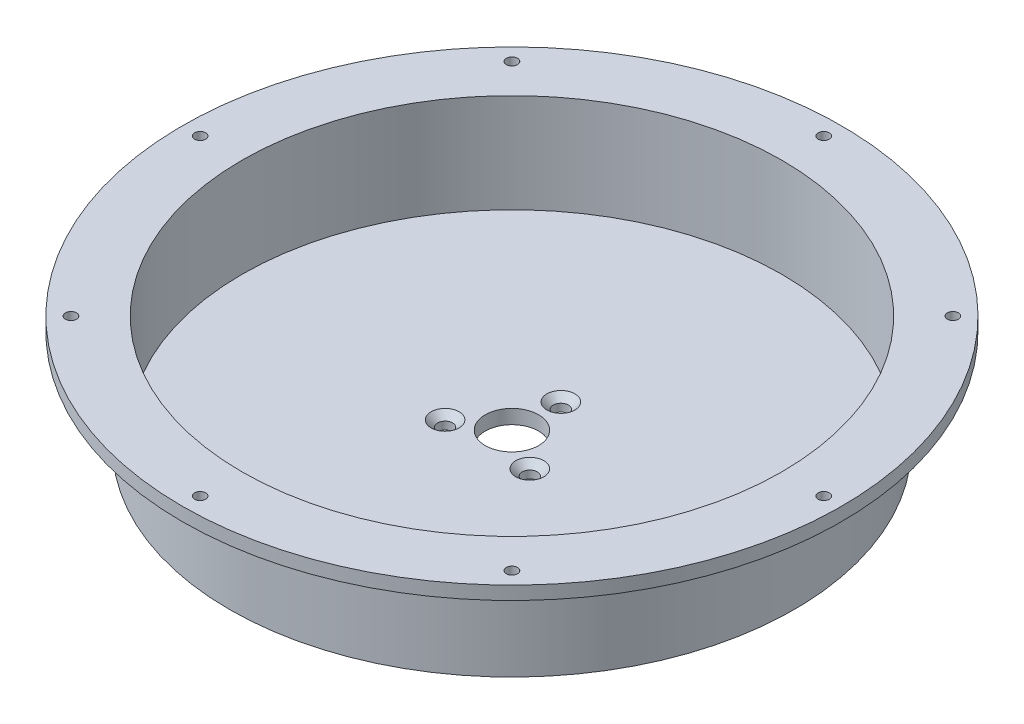
ISO-10303-21;
HEADER;
FILE_DESCRIPTION(('STEP AP214'),'2;1');
FILE_NAME('part.step','',(''),(''),'','','');
FILE_SCHEMA(('AUTOMOTIVE_DESIGN { 1 0 10303 214 1 1 1 1 }'));
ENDSEC;
DATA;
#1=APPLICATION_CONTEXT('core data for automotive mechanical design processes');
#2=APPLICATION_PROTOCOL_DEFINITION('international standard','automotive_design',2000,#1);
#3=PRODUCT_CONTEXT('',#1,'mechanical');
#4=PRODUCT('Part','Part','',(#3));
#5=PRODUCT_RELATED_PRODUCT_CATEGORY('part','',(#4));
#6=PRODUCT_DEFINITION_FORMATION('','',#4);
#7=PRODUCT_DEFINITION_CONTEXT('part definition',#1,'design');
#8=PRODUCT_DEFINITION('design','',#6,#7);
#9=PRODUCT_DEFINITION_SHAPE('','',#8);
#10=(LENGTH_UNIT() NAMED_UNIT(*) SI_UNIT(.MILLI.,.METRE.));
#11=(NAMED_UNIT(*) PLANE_ANGLE_UNIT() SI_UNIT($,.RADIAN.));
#12=(NAMED_UNIT(*) SI_UNIT($,.STERADIAN.) SOLID_ANGLE_UNIT());
#13=UNCERTAINTY_MEASURE_WITH_UNIT(LENGTH_MEASURE(1.E-05),#10,'distance_accuracy_value','');
#14=(GEOMETRIC_REPRESENTATION_CONTEXT(3) GLOBAL_UNCERTAINTY_ASSIGNED_CONTEXT((#13)) GLOBAL_UNIT_ASSIGNED_CONTEXT((#10,
#11,#12)) REPRESENTATION_CONTEXT('',''));
#15=CARTESIAN_POINT('',(0.,0.,0.));
#16=DIRECTION('',(0.,0.,1.));
#17=DIRECTION('',(1.,0.,0.));
#18=AXIS2_PLACEMENT_3D('',#15,#16,#17);
#19=CARTESIAN_POINT('',(0.,25.4,0.));
#20=DIRECTION('',(0.,-1.,0.));
#21=DIRECTION('',(0.,0.,-1.));
#22=AXIS2_PLACEMENT_3D('',#19,#20,#21);
#23=CYLINDRICAL_SURFACE('',#22,63.5);
#24=CARTESIAN_POINT('',(0.,19.4,0.));
#25=DIRECTION('',(0.,1.,0.));
#26=DIRECTION('',(0.,0.,1.));
#27=AXIS2_PLACEMENT_3D('',#24,#25,#26);
#28=CIRCLE('',#27,63.5);
#29=CARTESIAN_POINT('',(0.,19.4,63.5));
#30=VERTEX_POINT('',#29);
#31=EDGE_CURVE('E11',#30,#30,#28,.F.);
#32=ORIENTED_EDGE('',*,*,#31,.T.);
#33=EDGE_LOOP('',(#32));
#34=FACE_BOUND('',#33,.T.);
#35=CARTESIAN_POINT('',(0.,0.,0.));
#36=DIRECTION('',(0.,1.,0.));
#37=DIRECTION('',(0.,0.,1.));
#38=AXIS2_PLACEMENT_3D('',#35,#36,#37);
#39=CIRCLE('',#38,63.5);
#40=CARTESIAN_POINT('',(0.,0.,63.5));
#41=VERTEX_POINT('',#40);
#42=EDGE_CURVE('E74',#41,#41,#39,.T.);
#43=ORIENTED_EDGE('',*,*,#42,.T.);
#44=EDGE_LOOP('',(#43));
#45=FACE_BOUND('',#44,.T.);
#46=ADVANCED_FACE('F56',(#34,#45),#23,.T.);
#47=CARTESIAN_POINT('',(0.,25.4,0.));
#48=DIRECTION('',(0.,1.,0.));
#49=DIRECTION('',(0.,0.,1.));
#50=AXIS2_PLACEMENT_3D('',#47,#48,#49);
#51=PLANE('',#50);
#52=CARTESIAN_POINT('',(49.5681853611764,25.4,-49.5681853611776));
#53=DIRECTION('',(0.,1.,0.));
#54=DIRECTION('',(0.,0.,1.));
#55=AXIS2_PLACEMENT_3D('',#52,#53,#54);
#56=CIRCLE('',#55,1.24999999999999);
#57=CARTESIAN_POINT('',(49.5681853611764,25.4,-48.3181853611776));
#58=VERTEX_POINT('',#57);
#59=EDGE_CURVE('E82',#58,#58,#56,.T.);
#60=ORIENTED_EDGE('',*,*,#59,.F.);
#61=EDGE_LOOP('',(#60));
#62=FACE_BOUND('',#61,.T.);
#63=CARTESIAN_POINT('',(70.1,25.4,-7.34258525558711E-13));
#64=DIRECTION('',(0.,1.,0.));
#65=DIRECTION('',(0.,0.,1.));
#66=AXIS2_PLACEMENT_3D('',#63,#64,#65);
#67=CIRCLE('',#66,1.24999999999999);
#68=CARTESIAN_POINT('',(70.1,25.4,1.24999999999925));
#69=VERTEX_POINT('',#68);
#70=EDGE_CURVE('E81',#69,#69,#67,.T.);
#71=ORIENTED_EDGE('',*,*,#70,.F.);
#72=EDGE_LOOP('',(#71));
#73=FACE_BOUND('',#72,.T.);
#74=CARTESIAN_POINT('',(49.5681853611774,25.4,49.5681853611765));
#75=DIRECTION('',(0.,1.,0.));
#76=DIRECTION('',(0.,0.,1.));
#77=AXIS2_PLACEMENT_3D('',#74,#75,#76);
#78=CIRCLE('',#77,1.24999999999999);
#79=CARTESIAN_POINT('',(49.5681853611774,25.4,50.8181853611765));
#80=VERTEX_POINT('',#79);
#81=EDGE_CURVE('E88',#80,#80,#78,.T.);
#82=ORIENTED_EDGE('',*,*,#81,.F.);
#83=EDGE_LOOP('',(#82));
#84=FACE_BOUND('',#83,.T.);
#85=CARTESIAN_POINT('',(0.,25.4,70.1));
#86=DIRECTION('',(0.,1.,0.));
#87=DIRECTION('',(0.,0.,1.));
#88=AXIS2_PLACEMENT_3D('',#85,#86,#87);
#89=CIRCLE('',#88,1.24999999999999);
#90=CARTESIAN_POINT('',(0.,25.4,71.35));
#91=VERTEX_POINT('',#90);
#92=EDGE_CURVE('E87',#91,#91,#89,.T.);
#93=ORIENTED_EDGE('',*,*,#92,.F.);
#94=EDGE_LOOP('',(#93));
#95=FACE_BOUND('',#94,.T.);
#96=CARTESIAN_POINT('',(-49.5681853611767,25.4,49.5681853611772));
#97=DIRECTION('',(0.,1.,0.));
#98=DIRECTION('',(0.,0.,1.));
#99=AXIS2_PLACEMENT_3D('',#96,#97,#98);
#100=CIRCLE('',#99,1.24999999999999);
#101=CARTESIAN_POINT('',(-49.5681853611767,25.4,50.8181853611772));
#102=VERTEX_POINT('',#101);
#103=EDGE_CURVE('E94',#102,#102,#100,.T.);
#104=ORIENTED_EDGE('',*,*,#103,.F.);
#105=EDGE_LOOP('',(#104));
#106=FACE_BOUND('',#105,.T.);
#107=CARTESIAN_POINT('',(-70.1,25.4,2.44752841852904E-13));
#108=DIRECTION('',(0.,1.,0.));
#109=DIRECTION('',(0.,0.,1.));
#110=AXIS2_PLACEMENT_3D('',#107,#108,#109);
#111=CIRCLE('',#110,1.24999999999999);
#112=CARTESIAN_POINT('',(-70.1,25.4,1.25000000000023));
#113=VERTEX_POINT('',#112);
#114=EDGE_CURVE('E93',#113,#113,#111,.T.);
#115=ORIENTED_EDGE('',*,*,#114,.F.);
#116=EDGE_LOOP('',(#115));
#117=FACE_BOUND('',#116,.T.);
#118=CARTESIAN_POINT('',(-49.5681853611771,25.4,-49.5681853611769));
#119=DIRECTION('',(0.,1.,0.));
#120=DIRECTION('',(0.,0.,1.));
#121=AXIS2_PLACEMENT_3D('',#118,#119,#120);
#122=CIRCLE('',#121,1.24999999999999);
#123=CARTESIAN_POINT('',(-49.5681853611771,25.4,-48.3181853611769));
#124=VERTEX_POINT('',#123);
#125=EDGE_CURVE('E99',#124,#124,#122,.T.);
#126=ORIENTED_EDGE('',*,*,#125,.F.);
#127=EDGE_LOOP('',(#126));
#128=FACE_BOUND('',#127,.T.);
#129=CARTESIAN_POINT('',(0.,25.4,-70.1));
#130=DIRECTION('',(0.,1.,0.));
#131=DIRECTION('',(0.,0.,1.));
#132=AXIS2_PLACEMENT_3D('',#129,#130,#131);
#133=CIRCLE('',#132,1.24999999999999);
#134=CARTESIAN_POINT('',(0.,25.4,-68.85));
#135=VERTEX_POINT('',#134);
#136=EDGE_CURVE('E98',#135,#135,#133,.T.);
#137=ORIENTED_EDGE('',*,*,#136,.F.);
#138=EDGE_LOOP('',(#137));
#139=FACE_BOUND('',#138,.T.);
#140=CARTESIAN_POINT('',(0.,25.4,0.));
#141=DIRECTION('',(0.,1.,0.));
#142=DIRECTION('',(0.,0.,1.));
#143=AXIS2_PLACEMENT_3D('',#140,#141,#142);
#144=CIRCLE('',#143,60.690000065);
#145=CARTESIAN_POINT('',(0.,25.4,60.690000065));
#146=VERTEX_POINT('',#145);
#147=EDGE_CURVE('E104',#146,#146,#144,.T.);
#148=ORIENTED_EDGE('',*,*,#147,.F.);
#149=EDGE_LOOP('',(#148));
#150=FACE_BOUND('',#149,.T.);
#151=CARTESIAN_POINT('',(0.,25.4,0.));
#152=DIRECTION('',(0.,1.,0.));
#153=DIRECTION('',(0.,0.,1.));
#154=AXIS2_PLACEMENT_3D('',#151,#152,#153);
#155=CIRCLE('',#154,74.0950000325);
#156=CARTESIAN_POINT('',(0.,25.4,74.0950000325));
#157=VERTEX_POINT('',#156);
#158=EDGE_CURVE('E117',#157,#157,#155,.T.);
#159=ORIENTED_EDGE('',*,*,#158,.T.);
#160=EDGE_LOOP('',(#159));
#161=FACE_BOUND('',#160,.T.);
#162=ADVANCED_FACE('F223',(#62,#73,#84,#95,#106,#117,#128,#139,#150,#161),#51,.T.);
#163=CARTESIAN_POINT('',(0.,0.,0.));
#164=DIRECTION('',(0.,1.,0.));
#165=DIRECTION('',(0.,0.,1.));
#166=AXIS2_PLACEMENT_3D('',#163,#164,#165);
#167=PLANE('',#166);
#168=CARTESIAN_POINT('',(-9.52627944162887,0.,5.49999999999991));
#169=DIRECTION('',(0.,1.,0.));
#170=DIRECTION('',(0.,0.,1.));
#171=AXIS2_PLACEMENT_3D('',#168,#169,#170);
#172=CIRCLE('',#171,1.7);
#173=CARTESIAN_POINT('',(-9.52627944162887,0.,7.19999999999991));
#174=VERTEX_POINT('',#173);
#175=EDGE_CURVE('E188',#174,#174,#172,.T.);
#176=ORIENTED_EDGE('',*,*,#175,.T.);
#177=EDGE_LOOP('',(#176));
#178=FACE_BOUND('',#177,.T.);
#179=CARTESIAN_POINT('',(9.5262794416288,0.,5.50000000000004));
#180=DIRECTION('',(0.,1.,0.));
#181=DIRECTION('',(0.,0.,1.));
#182=AXIS2_PLACEMENT_3D('',#179,#180,#181);
#183=CIRCLE('',#182,1.7);
#184=CARTESIAN_POINT('',(9.5262794416288,0.,7.20000000000004));
#185=VERTEX_POINT('',#184);
#186=EDGE_CURVE('E176',#185,#185,#183,.T.);
#187=ORIENTED_EDGE('',*,*,#186,.T.);
#188=EDGE_LOOP('',(#187));
#189=FACE_BOUND('',#188,.T.);
#190=CARTESIAN_POINT('',(0.,0.,-11.));
#191=DIRECTION('',(0.,1.,0.));
#192=DIRECTION('',(0.,0.,1.));
#193=AXIS2_PLACEMENT_3D('',#190,#191,#192);
#194=CIRCLE('',#193,1.7);
#195=CARTESIAN_POINT('',(0.,0.,-9.3));
#196=VERTEX_POINT('',#195);
#197=EDGE_CURVE('E164',#196,#196,#194,.T.);
#198=ORIENTED_EDGE('',*,*,#197,.T.);
#199=EDGE_LOOP('',(#198));
#200=FACE_BOUND('',#199,.T.);
#201=CARTESIAN_POINT('',(0.,0.,0.));
#202=DIRECTION('',(0.,-1.,0.));
#203=DIRECTION('',(0.,0.,-1.));
#204=AXIS2_PLACEMENT_3D('',#201,#202,#203);
#205=CIRCLE('',#204,6.);
#206=CARTESIAN_POINT('',(0.,0.,-6.));
#207=VERTEX_POINT('',#206);
#208=EDGE_CURVE('E108',#207,#207,#205,.T.);
#209=ORIENTED_EDGE('',*,*,#208,.F.);
#210=EDGE_LOOP('',(#209));
#211=FACE_BOUND('',#210,.T.);
#212=ORIENTED_EDGE('',*,*,#42,.F.);
#213=EDGE_LOOP('',(#212));
#214=FACE_BOUND('',#213,.T.);
#215=ADVANCED_FACE('F219',(#178,#189,#200,#211,#214),#167,.F.);
#216=CARTESIAN_POINT('',(0.,25.4,0.));
#217=DIRECTION('',(0.,-1.,0.));
#218=DIRECTION('',(0.,0.,-1.));
#219=AXIS2_PLACEMENT_3D('',#216,#217,#218);
#220=CYLINDRICAL_SURFACE('',#219,60.690000065);
#221=CARTESIAN_POINT('',(0.,3.175,0.));
#222=DIRECTION('',(0.,1.,0.));
#223=DIRECTION('',(0.,0.,1.));
#224=AXIS2_PLACEMENT_3D('',#221,#222,#223);
#225=CIRCLE('',#224,60.690000065);
#226=CARTESIAN_POINT('',(0.,3.175,60.690000065));
#227=VERTEX_POINT('',#226);
#228=EDGE_CURVE('E69',#227,#227,#225,.T.);
#229=ORIENTED_EDGE('',*,*,#228,.F.);
#230=EDGE_LOOP('',(#229));
#231=FACE_BOUND('',#230,.T.);
#232=ORIENTED_EDGE('',*,*,#147,.T.);
#233=EDGE_LOOP('',(#232));
#234=FACE_BOUND('',#233,.T.);
#235=ADVANCED_FACE('F207',(#231,#234),#220,.F.);
#236=CARTESIAN_POINT('',(0.,3.175,0.));
#237=DIRECTION('',(0.,1.,0.));
#238=DIRECTION('',(0.,0.,1.));
#239=AXIS2_PLACEMENT_3D('',#236,#237,#238);
#240=PLANE('',#239);
#241=CARTESIAN_POINT('',(-9.52627944162887,3.175,5.49999999999991));
#242=DIRECTION('',(0.,1.,0.));
#243=DIRECTION('',(0.,0.,1.));
#244=AXIS2_PLACEMENT_3D('',#241,#242,#243);
#245=CIRCLE('',#244,3.15);
#246=CARTESIAN_POINT('',(-9.52627944162887,3.175,8.64999999999991));
#247=VERTEX_POINT('',#246);
#248=EDGE_CURVE('E196',#247,#247,#245,.T.);
#249=ORIENTED_EDGE('',*,*,#248,.F.);
#250=EDGE_LOOP('',(#249));
#251=FACE_BOUND('',#250,.T.);
#252=CARTESIAN_POINT('',(9.5262794416288,3.175,5.50000000000004));
#253=DIRECTION('',(0.,1.,0.));
#254=DIRECTION('',(0.,0.,1.));
#255=AXIS2_PLACEMENT_3D('',#252,#253,#254);
#256=CIRCLE('',#255,3.15);
#257=CARTESIAN_POINT('',(9.5262794416288,3.175,8.65000000000004));
#258=VERTEX_POINT('',#257);
#259=EDGE_CURVE('E184',#258,#258,#256,.T.);
#260=ORIENTED_EDGE('',*,*,#259,.F.);
#261=EDGE_LOOP('',(#260));
#262=FACE_BOUND('',#261,.T.);
#263=CARTESIAN_POINT('',(0.,3.175,-11.));
#264=DIRECTION('',(0.,1.,0.));
#265=DIRECTION('',(0.,0.,1.));
#266=AXIS2_PLACEMENT_3D('',#263,#264,#265);
#267=CIRCLE('',#266,3.15);
#268=CARTESIAN_POINT('',(0.,3.175,-7.85));
#269=VERTEX_POINT('',#268);
#270=EDGE_CURVE('E172',#269,#269,#267,.T.);
#271=ORIENTED_EDGE('',*,*,#270,.F.);
#272=EDGE_LOOP('',(#271));
#273=FACE_BOUND('',#272,.T.);
#274=CARTESIAN_POINT('',(0.,3.175,0.));
#275=DIRECTION('',(0.,1.,0.));
#276=DIRECTION('',(0.,0.,1.));
#277=AXIS2_PLACEMENT_3D('',#274,#275,#276);
#278=CIRCLE('',#277,6.);
#279=CARTESIAN_POINT('',(0.,3.175,6.));
#280=VERTEX_POINT('',#279);
#281=EDGE_CURVE('E109',#280,#280,#278,.F.);
#282=ORIENTED_EDGE('',*,*,#281,.T.);
#283=EDGE_LOOP('',(#282));
#284=FACE_BOUND('',#283,.T.);
#285=ORIENTED_EDGE('',*,*,#228,.T.);
#286=EDGE_LOOP('',(#285));
#287=FACE_BOUND('',#286,.T.);
#288=ADVANCED_FACE('F203',(#251,#262,#273,#284,#287),#240,.T.);
#289=CARTESIAN_POINT('',(0.,25.401,0.));
#290=DIRECTION('',(0.,-1.,0.));
#291=DIRECTION('',(0.,0.,-1.));
#292=AXIS2_PLACEMENT_3D('',#289,#290,#291);
#293=CYLINDRICAL_SURFACE('',#292,6.);
#294=ORIENTED_EDGE('',*,*,#281,.F.);
#295=EDGE_LOOP('',(#294));
#296=FACE_BOUND('',#295,.T.);
#297=ORIENTED_EDGE('',*,*,#208,.T.);
#298=EDGE_LOOP('',(#297));
#299=FACE_BOUND('',#298,.T.);
#300=ADVANCED_FACE('F206',(#296,#299),#293,.F.);
#301=CARTESIAN_POINT('',(0.,22.4,0.));
#302=DIRECTION('',(0.,1.,0.));
#303=DIRECTION('',(0.,0.,1.));
#304=AXIS2_PLACEMENT_3D('',#301,#302,#303);
#305=CYLINDRICAL_SURFACE('',#304,74.0950000325);
#306=CARTESIAN_POINT('',(0.,22.4,0.));
#307=DIRECTION('',(0.,1.,0.));
#308=DIRECTION('',(0.,0.,1.));
#309=AXIS2_PLACEMENT_3D('',#306,#307,#308);
#310=CIRCLE('',#309,74.0950000325);
#311=CARTESIAN_POINT('',(0.,22.4,74.0950000325));
#312=VERTEX_POINT('',#311);
#313=EDGE_CURVE('E113',#312,#312,#310,.T.);
#314=ORIENTED_EDGE('',*,*,#313,.T.);
#315=EDGE_LOOP('',(#314));
#316=FACE_BOUND('',#315,.T.);
#317=ORIENTED_EDGE('',*,*,#158,.F.);
#318=EDGE_LOOP('',(#317));
#319=FACE_BOUND('',#318,.T.);
#320=ADVANCED_FACE('F230',(#316,#319),#305,.T.);
#321=CARTESIAN_POINT('',(0.,22.4,0.));
#322=DIRECTION('',(0.,1.,0.));
#323=DIRECTION('',(0.,0.,1.));
#324=AXIS2_PLACEMENT_3D('',#321,#322,#323);
#325=PLANE('',#324);
#326=CARTESIAN_POINT('',(0.,22.4,0.));
#327=DIRECTION('',(0.,1.,0.));
#328=DIRECTION('',(0.,0.,1.));
#329=AXIS2_PLACEMENT_3D('',#326,#327,#328);
#330=CIRCLE('',#329,66.5);
#331=CARTESIAN_POINT('',(0.,22.4,66.5));
#332=VERTEX_POINT('',#331);
#333=EDGE_CURVE('E64',#332,#332,#330,.T.);
#334=ORIENTED_EDGE('',*,*,#333,.T.);
#335=EDGE_LOOP('',(#334));
#336=FACE_BOUND('',#335,.T.);
#337=CARTESIAN_POINT('',(49.5681853611764,22.4,-49.5681853611776));
#338=DIRECTION('',(0.,1.,0.));
#339=DIRECTION('',(0.,0.,1.));
#340=AXIS2_PLACEMENT_3D('',#337,#338,#339);
#341=CIRCLE('',#340,1.24999999999999);
#342=CARTESIAN_POINT('',(49.5681853611764,22.4,-48.3181853611776));
#343=VERTEX_POINT('',#342);
#344=EDGE_CURVE('E77',#343,#343,#341,.T.);
#345=ORIENTED_EDGE('',*,*,#344,.T.);
#346=EDGE_LOOP('',(#345));
#347=FACE_BOUND('',#346,.T.);
#348=CARTESIAN_POINT('',(70.1,22.4,-7.34258525558711E-13));
#349=DIRECTION('',(0.,1.,0.));
#350=DIRECTION('',(0.,0.,1.));
#351=AXIS2_PLACEMENT_3D('',#348,#349,#350);
#352=CIRCLE('',#351,1.24999999999999);
#353=CARTESIAN_POINT('',(70.1,22.4,1.24999999999925));
#354=VERTEX_POINT('',#353);
#355=EDGE_CURVE('E154',#354,#354,#352,.T.);
#356=ORIENTED_EDGE('',*,*,#355,.T.);
#357=EDGE_LOOP('',(#356));
#358=FACE_BOUND('',#357,.T.);
#359=CARTESIAN_POINT('',(49.5681853611774,22.4,49.5681853611765));
#360=DIRECTION('',(0.,1.,0.));
#361=DIRECTION('',(0.,0.,1.));
#362=AXIS2_PLACEMENT_3D('',#359,#360,#361);
#363=CIRCLE('',#362,1.24999999999999);
#364=CARTESIAN_POINT('',(49.5681853611774,22.4,50.8181853611765));
#365=VERTEX_POINT('',#364);
#366=EDGE_CURVE('E83',#365,#365,#363,.T.);
#367=ORIENTED_EDGE('',*,*,#366,.T.);
#368=EDGE_LOOP('',(#367));
#369=FACE_BOUND('',#368,.T.);
#370=CARTESIAN_POINT('',(0.,22.4,70.1));
#371=DIRECTION('',(0.,1.,0.));
#372=DIRECTION('',(0.,0.,1.));
#373=AXIS2_PLACEMENT_3D('',#370,#371,#372);
#374=CIRCLE('',#373,1.24999999999999);
#375=CARTESIAN_POINT('',(0.,22.4,71.35));
#376=VERTEX_POINT('',#375);
#377=EDGE_CURVE('E144',#376,#376,#374,.T.);
#378=ORIENTED_EDGE('',*,*,#377,.T.);
#379=EDGE_LOOP('',(#378));
#380=FACE_BOUND('',#379,.T.);
#381=CARTESIAN_POINT('',(-49.5681853611767,22.4,49.5681853611772));
#382=DIRECTION('',(0.,1.,0.));
#383=DIRECTION('',(0.,0.,1.));
#384=AXIS2_PLACEMENT_3D('',#381,#382,#383);
#385=CIRCLE('',#384,1.24999999999999);
#386=CARTESIAN_POINT('',(-49.5681853611767,22.4,50.8181853611772));
#387=VERTEX_POINT('',#386);
#388=EDGE_CURVE('E89',#387,#387,#385,.T.);
#389=ORIENTED_EDGE('',*,*,#388,.T.);
#390=EDGE_LOOP('',(#389));
#391=FACE_BOUND('',#390,.T.);
#392=CARTESIAN_POINT('',(-70.1,22.4,2.44752841852904E-13));
#393=DIRECTION('',(0.,1.,0.));
#394=DIRECTION('',(0.,0.,1.));
#395=AXIS2_PLACEMENT_3D('',#392,#393,#394);
#396=CIRCLE('',#395,1.24999999999999);
#397=CARTESIAN_POINT('',(-70.1,22.4,1.25000000000023));
#398=VERTEX_POINT('',#397);
#399=EDGE_CURVE('E134',#398,#398,#396,.T.);
#400=ORIENTED_EDGE('',*,*,#399,.T.);
#401=EDGE_LOOP('',(#400));
#402=FACE_BOUND('',#401,.T.);
#403=CARTESIAN_POINT('',(-49.5681853611771,22.4,-49.5681853611769));
#404=DIRECTION('',(0.,1.,0.));
#405=DIRECTION('',(0.,0.,1.));
#406=AXIS2_PLACEMENT_3D('',#403,#404,#405);
#407=CIRCLE('',#406,1.24999999999999);
#408=CARTESIAN_POINT('',(-49.5681853611771,22.4,-48.3181853611769));
#409=VERTEX_POINT('',#408);
#410=EDGE_CURVE('E95',#409,#409,#407,.T.);
#411=ORIENTED_EDGE('',*,*,#410,.T.);
#412=EDGE_LOOP('',(#411));
#413=FACE_BOUND('',#412,.T.);
#414=CARTESIAN_POINT('',(0.,22.4,-70.1));
#415=DIRECTION('',(0.,1.,0.));
#416=DIRECTION('',(0.,0.,1.));
#417=AXIS2_PLACEMENT_3D('',#414,#415,#416);
#418=CIRCLE('',#417,1.24999999999999);
#419=CARTESIAN_POINT('',(0.,22.4,-68.85));
#420=VERTEX_POINT('',#419);
#421=EDGE_CURVE('E121',#420,#420,#418,.T.);
#422=ORIENTED_EDGE('',*,*,#421,.T.);
#423=EDGE_LOOP('',(#422));
#424=FACE_BOUND('',#423,.T.);
#425=ORIENTED_EDGE('',*,*,#313,.F.);
#426=EDGE_LOOP('',(#425));
#427=FACE_BOUND('',#426,.T.);
#428=ADVANCED_FACE('F232',(#336,#347,#358,#369,#380,#391,#402,#413,#424,#427),#325,.F.);
#429=CARTESIAN_POINT('',(0.,25.4,-70.1));
#430=DIRECTION('',(0.,1.,0.));
#431=DIRECTION('',(0.,0.,1.));
#432=AXIS2_PLACEMENT_3D('',#429,#430,#431);
#433=CYLINDRICAL_SURFACE('',#432,1.24999999999999);
#434=ORIENTED_EDGE('',*,*,#136,.T.);
#435=EDGE_LOOP('',(#434));
#436=FACE_BOUND('',#435,.T.);
#437=ORIENTED_EDGE('',*,*,#421,.F.);
#438=EDGE_LOOP('',(#437));
#439=FACE_BOUND('',#438,.T.);
#440=ADVANCED_FACE('F240',(#436,#439),#433,.F.);
#441=CARTESIAN_POINT('',(-49.5681853611771,25.4,-49.5681853611769));
#442=DIRECTION('',(0.,1.,0.));
#443=DIRECTION('',(0.,0.,1.));
#444=AXIS2_PLACEMENT_3D('',#441,#442,#443);
#445=CYLINDRICAL_SURFACE('',#444,1.24999999999999);
#446=ORIENTED_EDGE('',*,*,#125,.T.);
#447=EDGE_LOOP('',(#446));
#448=FACE_BOUND('',#447,.T.);
#449=ORIENTED_EDGE('',*,*,#410,.F.);
#450=EDGE_LOOP('',(#449));
#451=FACE_BOUND('',#450,.T.);
#452=ADVANCED_FACE('F307',(#448,#451),#445,.F.);
#453=CARTESIAN_POINT('',(-70.1,25.4,2.44752841852904E-13));
#454=DIRECTION('',(0.,1.,0.));
#455=DIRECTION('',(0.,0.,1.));
#456=AXIS2_PLACEMENT_3D('',#453,#454,#455);
#457=CYLINDRICAL_SURFACE('',#456,1.24999999999999);
#458=ORIENTED_EDGE('',*,*,#114,.T.);
#459=EDGE_LOOP('',(#458));
#460=FACE_BOUND('',#459,.T.);
#461=ORIENTED_EDGE('',*,*,#399,.F.);
#462=EDGE_LOOP('',(#461));
#463=FACE_BOUND('',#462,.T.);
#464=ADVANCED_FACE('F303',(#460,#463),#457,.F.);
#465=CARTESIAN_POINT('',(-49.5681853611767,25.4,49.5681853611772));
#466=DIRECTION('',(0.,1.,0.));
#467=DIRECTION('',(0.,0.,1.));
#468=AXIS2_PLACEMENT_3D('',#465,#466,#467);
#469=CYLINDRICAL_SURFACE('',#468,1.24999999999999);
#470=ORIENTED_EDGE('',*,*,#103,.T.);
#471=EDGE_LOOP('',(#470));
#472=FACE_BOUND('',#471,.T.);
#473=ORIENTED_EDGE('',*,*,#388,.F.);
#474=EDGE_LOOP('',(#473));
#475=FACE_BOUND('',#474,.T.);
#476=ADVANCED_FACE('F299',(#472,#475),#469,.F.);
#477=CARTESIAN_POINT('',(0.,25.4,70.1));
#478=DIRECTION('',(0.,1.,0.));
#479=DIRECTION('',(0.,0.,1.));
#480=AXIS2_PLACEMENT_3D('',#477,#478,#479);
#481=CYLINDRICAL_SURFACE('',#480,1.24999999999999);
#482=ORIENTED_EDGE('',*,*,#92,.T.);
#483=EDGE_LOOP('',(#482));
#484=FACE_BOUND('',#483,.T.);
#485=ORIENTED_EDGE('',*,*,#377,.F.);
#486=EDGE_LOOP('',(#485));
#487=FACE_BOUND('',#486,.T.);
#488=ADVANCED_FACE('F295',(#484,#487),#481,.F.);
#489=CARTESIAN_POINT('',(49.5681853611774,25.4,49.5681853611765));
#490=DIRECTION('',(0.,1.,0.));
#491=DIRECTION('',(0.,0.,1.));
#492=AXIS2_PLACEMENT_3D('',#489,#490,#491);
#493=CYLINDRICAL_SURFACE('',#492,1.24999999999999);
#494=ORIENTED_EDGE('',*,*,#81,.T.);
#495=EDGE_LOOP('',(#494));
#496=FACE_BOUND('',#495,.T.);
#497=ORIENTED_EDGE('',*,*,#366,.F.);
#498=EDGE_LOOP('',(#497));
#499=FACE_BOUND('',#498,.T.);
#500=ADVANCED_FACE('F291',(#496,#499),#493,.F.);
#501=CARTESIAN_POINT('',(70.1,25.4,-7.34258525558711E-13));
#502=DIRECTION('',(0.,1.,0.));
#503=DIRECTION('',(0.,0.,1.));
#504=AXIS2_PLACEMENT_3D('',#501,#502,#503);
#505=CYLINDRICAL_SURFACE('',#504,1.24999999999999);
#506=ORIENTED_EDGE('',*,*,#70,.T.);
#507=EDGE_LOOP('',(#506));
#508=FACE_BOUND('',#507,.T.);
#509=ORIENTED_EDGE('',*,*,#355,.F.);
#510=EDGE_LOOP('',(#509));
#511=FACE_BOUND('',#510,.T.);
#512=ADVANCED_FACE('F287',(#508,#511),#505,.F.);
#513=CARTESIAN_POINT('',(49.5681853611764,25.4,-49.5681853611776));
#514=DIRECTION('',(0.,1.,0.));
#515=DIRECTION('',(0.,0.,1.));
#516=AXIS2_PLACEMENT_3D('',#513,#514,#515);
#517=CYLINDRICAL_SURFACE('',#516,1.24999999999999);
#518=ORIENTED_EDGE('',*,*,#59,.T.);
#519=EDGE_LOOP('',(#518));
#520=FACE_BOUND('',#519,.T.);
#521=ORIENTED_EDGE('',*,*,#344,.F.);
#522=EDGE_LOOP('',(#521));
#523=FACE_BOUND('',#522,.T.);
#524=ADVANCED_FACE('F284',(#520,#523),#517,.F.);
#525=CARTESIAN_POINT('',(0.,19.4,0.));
#526=DIRECTION('',(0.,1.,0.));
#527=DIRECTION('',(0.,0.,1.));
#528=AXIS2_PLACEMENT_3D('',#525,#526,#527);
#529=TOROIDAL_SURFACE('',#528,66.5,3.);
#530=ORIENTED_EDGE('',*,*,#31,.F.);
#531=EDGE_LOOP('',(#530));
#532=FACE_BOUND('',#531,.T.);
#533=ORIENTED_EDGE('',*,*,#333,.F.);
#534=EDGE_LOOP('',(#533));
#535=FACE_BOUND('',#534,.T.);
#536=ADVANCED_FACE('F58',(#532,#535),#529,.F.);
#537=CARTESIAN_POINT('',(0.,3.175,-11.));
#538=DIRECTION('',(0.,1.,0.));
#539=DIRECTION('',(0.,0.,1.));
#540=AXIS2_PLACEMENT_3D('',#537,#538,#539);
#541=CYLINDRICAL_SURFACE('',#540,1.7);
#542=ORIENTED_EDGE('',*,*,#197,.F.);
#543=EDGE_LOOP('',(#542));
#544=FACE_BOUND('',#543,.T.);
#545=CARTESIAN_POINT('',(0.,1.725,-11.));
#546=DIRECTION('',(0.,1.,0.));
#547=DIRECTION('',(0.,0.,1.));
#548=AXIS2_PLACEMENT_3D('',#545,#546,#547);
#549=CIRCLE('',#548,1.7);
#550=CARTESIAN_POINT('',(0.,1.725,-9.3));
#551=VERTEX_POINT('',#550);
#552=EDGE_CURVE('E168',#551,#551,#549,.T.);
#553=ORIENTED_EDGE('',*,*,#552,.T.);
#554=EDGE_LOOP('',(#553));
#555=FACE_BOUND('',#554,.T.);
#556=ADVANCED_FACE('F266',(#544,#555),#541,.F.);
#557=CARTESIAN_POINT('',(0.,3.175,-11.));
#558=DIRECTION('',(0.,1.,0.));
#559=DIRECTION('',(0.,0.,1.));
#560=AXIS2_PLACEMENT_3D('',#557,#558,#559);
#561=CONICAL_SURFACE('',#560,3.15,0.785398163397449);
#562=ORIENTED_EDGE('',*,*,#552,.F.);
#563=EDGE_LOOP('',(#562));
#564=FACE_BOUND('',#563,.T.);
#565=ORIENTED_EDGE('',*,*,#270,.T.);
#566=EDGE_LOOP('',(#565));
#567=FACE_BOUND('',#566,.T.);
#568=ADVANCED_FACE('F269',(#564,#567),#561,.F.);
#569=CARTESIAN_POINT('',(9.5262794416288,3.175,5.50000000000004));
#570=DIRECTION('',(0.,1.,0.));
#571=DIRECTION('',(0.,0.,1.));
#572=AXIS2_PLACEMENT_3D('',#569,#570,#571);
#573=CYLINDRICAL_SURFACE('',#572,1.7);
#574=ORIENTED_EDGE('',*,*,#186,.F.);
#575=EDGE_LOOP('',(#574));
#576=FACE_BOUND('',#575,.T.);
#577=CARTESIAN_POINT('',(9.5262794416288,1.725,5.50000000000004));
#578=DIRECTION('',(0.,1.,0.));
#579=DIRECTION('',(0.,0.,1.));
#580=AXIS2_PLACEMENT_3D('',#577,#578,#579);
#581=CIRCLE('',#580,1.7);
#582=CARTESIAN_POINT('',(9.5262794416288,1.725,7.20000000000004));
#583=VERTEX_POINT('',#582);
#584=EDGE_CURVE('E180',#583,#583,#581,.T.);
#585=ORIENTED_EDGE('',*,*,#584,.T.);
#586=EDGE_LOOP('',(#585));
#587=FACE_BOUND('',#586,.T.);
#588=ADVANCED_FACE('F274',(#576,#587),#573,.F.);
#589=CARTESIAN_POINT('',(9.5262794416288,3.175,5.50000000000004));
#590=DIRECTION('',(0.,1.,0.));
#591=DIRECTION('',(0.,0.,1.));
#592=AXIS2_PLACEMENT_3D('',#589,#590,#591);
#593=CONICAL_SURFACE('',#592,3.15,0.785398163397449);
#594=ORIENTED_EDGE('',*,*,#584,.F.);
#595=EDGE_LOOP('',(#594));
#596=FACE_BOUND('',#595,.T.);
#597=ORIENTED_EDGE('',*,*,#259,.T.);
#598=EDGE_LOOP('',(#597));
#599=FACE_BOUND('',#598,.T.);
#600=ADVANCED_FACE('F279',(#596,#599),#593,.F.);
#601=CARTESIAN_POINT('',(-9.52627944162887,3.175,5.49999999999991));
#602=DIRECTION('',(0.,1.,0.));
#603=DIRECTION('',(0.,0.,1.));
#604=AXIS2_PLACEMENT_3D('',#601,#602,#603);
#605=CYLINDRICAL_SURFACE('',#604,1.7);
#606=ORIENTED_EDGE('',*,*,#175,.F.);
#607=EDGE_LOOP('',(#606));
#608=FACE_BOUND('',#607,.T.);
#609=CARTESIAN_POINT('',(-9.52627944162887,1.725,5.49999999999991));
#610=DIRECTION('',(0.,1.,0.));
#611=DIRECTION('',(0.,0.,1.));
#612=AXIS2_PLACEMENT_3D('',#609,#610,#611);
#613=CIRCLE('',#612,1.7);
#614=CARTESIAN_POINT('',(-9.52627944162887,1.725,7.19999999999991));
#615=VERTEX_POINT('',#614);
#616=EDGE_CURVE('E192',#615,#615,#613,.T.);
#617=ORIENTED_EDGE('',*,*,#616,.T.);
#618=EDGE_LOOP('',(#617));
#619=FACE_BOUND('',#618,.T.);
#620=ADVANCED_FACE('F497',(#608,#619),#605,.F.);
#621=CARTESIAN_POINT('',(-9.52627944162887,3.175,5.49999999999991));
#622=DIRECTION('',(0.,1.,0.));
#623=DIRECTION('',(0.,0.,1.));
#624=AXIS2_PLACEMENT_3D('',#621,#622,#623);
#625=CONICAL_SURFACE('',#624,3.15,0.785398163397449);
#626=ORIENTED_EDGE('',*,*,#616,.F.);
#627=EDGE_LOOP('',(#626));
#628=FACE_BOUND('',#627,.T.);
#629=ORIENTED_EDGE('',*,*,#248,.T.);
#630=EDGE_LOOP('',(#629));
#631=FACE_BOUND('',#630,.T.);
#632=ADVANCED_FACE('F201',(#628,#631),#625,.F.);
#633=CLOSED_SHELL('',(#46,#162,#215,#235,#288,#300,#320,#428,#440,#452,#464,#476,#488,#500,#512,
#524,#536,#556,#568,#588,#600,#620,#632));
#634=MANIFOLD_SOLID_BREP('B2',#633);
#635=ADVANCED_BREP_SHAPE_REPRESENTATION('',(#18,#634),#14);
#636=SHAPE_DEFINITION_REPRESENTATION(#9,#635);
ENDSEC;
END-ISO-10303-21;
